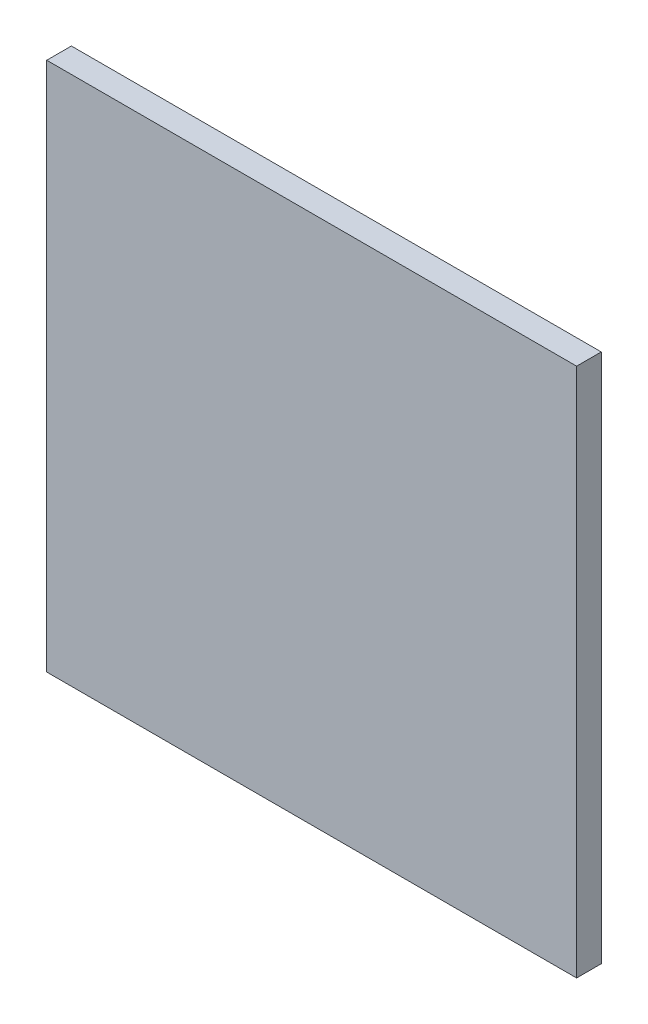
ISO-10303-21;
HEADER;
FILE_DESCRIPTION(('STEP AP214'),'2;1');
FILE_NAME('part.step','',(''),(''),'','','');
FILE_SCHEMA(('AUTOMOTIVE_DESIGN { 1 0 10303 214 1 1 1 1 }'));
ENDSEC;
DATA;
#1=APPLICATION_CONTEXT('core data for automotive mechanical design processes');
#2=APPLICATION_PROTOCOL_DEFINITION('international standard','automotive_design',2000,#1);
#3=PRODUCT_CONTEXT('',#1,'mechanical');
#4=PRODUCT('Part','Part','',(#3));
#5=PRODUCT_RELATED_PRODUCT_CATEGORY('part','',(#4));
#6=PRODUCT_DEFINITION_FORMATION('','',#4);
#7=PRODUCT_DEFINITION_CONTEXT('part definition',#1,'design');
#8=PRODUCT_DEFINITION('design','',#6,#7);
#9=PRODUCT_DEFINITION_SHAPE('','',#8);
#10=(LENGTH_UNIT() NAMED_UNIT(*) SI_UNIT(.MILLI.,.METRE.));
#11=(NAMED_UNIT(*) PLANE_ANGLE_UNIT() SI_UNIT($,.RADIAN.));
#12=(NAMED_UNIT(*) SI_UNIT($,.STERADIAN.) SOLID_ANGLE_UNIT());
#13=UNCERTAINTY_MEASURE_WITH_UNIT(LENGTH_MEASURE(1.E-05),#10,'distance_accuracy_value','');
#14=(GEOMETRIC_REPRESENTATION_CONTEXT(3) GLOBAL_UNCERTAINTY_ASSIGNED_CONTEXT((#13)) GLOBAL_UNIT_ASSIGNED_CONTEXT((#10,
#11,#12)) REPRESENTATION_CONTEXT('',''));
#15=CARTESIAN_POINT('',(0.,0.,0.));
#16=DIRECTION('',(0.,0.,1.));
#17=DIRECTION('',(1.,0.,0.));
#18=AXIS2_PLACEMENT_3D('',#15,#16,#17);
#19=CARTESIAN_POINT('',(-0.2149983,-0.2149983,0.02));
#20=DIRECTION('',(0.,0.,1.));
#21=DIRECTION('',(1.,0.,0.));
#22=AXIS2_PLACEMENT_3D('',#19,#20,#21);
#23=PLANE('',#22);
#24=DIRECTION('',(1.,0.,0.));
#25=VECTOR('',#24,1.);
#26=CARTESIAN_POINT('',(-0.2149983,0.2149983,0.02));
#27=LINE('',#26,#25);
#28=CARTESIAN_POINT('',(-0.2149983,0.2149983,0.02));
#29=VERTEX_POINT('',#28);
#30=CARTESIAN_POINT('',(0.2149983,0.2149983,0.02));
#31=VERTEX_POINT('',#30);
#32=EDGE_CURVE('E53',#29,#31,#27,.T.);
#33=ORIENTED_EDGE('',*,*,#32,.F.);
#34=DIRECTION('',(0.,1.,0.));
#35=VECTOR('',#34,1.);
#36=CARTESIAN_POINT('',(-0.2149983,-0.2149983,0.02));
#37=LINE('',#36,#35);
#38=CARTESIAN_POINT('',(-0.2149983,-0.2149983,0.02));
#39=VERTEX_POINT('',#38);
#40=EDGE_CURVE('E68',#39,#29,#37,.T.);
#41=ORIENTED_EDGE('',*,*,#40,.F.);
#42=DIRECTION('',(1.,0.,0.));
#43=VECTOR('',#42,1.);
#44=CARTESIAN_POINT('',(0.2149983,-0.2149983,0.02));
#45=LINE('',#44,#43);
#46=CARTESIAN_POINT('',(0.2149983,-0.2149983,0.02));
#47=VERTEX_POINT('',#46);
#48=EDGE_CURVE('E20',#47,#39,#45,.F.);
#49=ORIENTED_EDGE('',*,*,#48,.F.);
#50=DIRECTION('',(0.,1.,0.));
#51=VECTOR('',#50,1.);
#52=CARTESIAN_POINT('',(0.2149983,0.2149983,0.02));
#53=LINE('',#52,#51);
#54=EDGE_CURVE('E58',#31,#47,#53,.F.);
#55=ORIENTED_EDGE('',*,*,#54,.F.);
#56=EDGE_LOOP('',(#33,#41,#49,#55));
#57=FACE_BOUND('',#56,.T.);
#58=ADVANCED_FACE('F17',(#57),#23,.T.);
#59=CARTESIAN_POINT('',(0.2149983,-0.2149983,0.));
#60=DIRECTION('',(0.,-1.,0.));
#61=DIRECTION('',(0.,0.,-1.));
#62=AXIS2_PLACEMENT_3D('',#59,#60,#61);
#63=PLANE('',#62);
#64=DIRECTION('',(0.,0.,1.));
#65=VECTOR('',#64,1.);
#66=CARTESIAN_POINT('',(-0.2149983,-0.2149983,0.));
#67=LINE('',#66,#65);
#68=CARTESIAN_POINT('',(-0.2149983,-0.2149983,0.));
#69=VERTEX_POINT('',#68);
#70=EDGE_CURVE('E79',#69,#39,#67,.T.);
#71=ORIENTED_EDGE('',*,*,#70,.F.);
#72=DIRECTION('',(1.,0.,0.));
#73=VECTOR('',#72,1.);
#74=CARTESIAN_POINT('',(-0.2149983,-0.2149983,0.));
#75=LINE('',#74,#73);
#76=CARTESIAN_POINT('',(0.2149983,-0.2149983,0.));
#77=VERTEX_POINT('',#76);
#78=EDGE_CURVE('E74',#69,#77,#75,.T.);
#79=ORIENTED_EDGE('',*,*,#78,.T.);
#80=DIRECTION('',(0.,0.,-1.));
#81=VECTOR('',#80,1.);
#82=CARTESIAN_POINT('',(0.2149983,-0.2149983,0.));
#83=LINE('',#82,#81);
#84=EDGE_CURVE('E63',#47,#77,#83,.T.);
#85=ORIENTED_EDGE('',*,*,#84,.F.);
#86=ORIENTED_EDGE('',*,*,#48,.T.);
#87=EDGE_LOOP('',(#71,#79,#85,#86));
#88=FACE_BOUND('',#87,.T.);
#89=ADVANCED_FACE('F73',(#88),#63,.T.);
#90=CARTESIAN_POINT('',(0.2149983,0.2149983,0.));
#91=DIRECTION('',(1.,0.,0.));
#92=DIRECTION('',(0.,0.,-1.));
#93=AXIS2_PLACEMENT_3D('',#90,#91,#92);
#94=PLANE('',#93);
#95=ORIENTED_EDGE('',*,*,#84,.T.);
#96=DIRECTION('',(0.,1.,0.));
#97=VECTOR('',#96,1.);
#98=CARTESIAN_POINT('',(0.2149983,-0.2149983,0.));
#99=LINE('',#98,#97);
#100=CARTESIAN_POINT('',(0.2149983,0.2149983,0.));
#101=VERTEX_POINT('',#100);
#102=EDGE_CURVE('E84',#77,#101,#99,.T.);
#103=ORIENTED_EDGE('',*,*,#102,.T.);
#104=DIRECTION('',(0.,0.,1.));
#105=VECTOR('',#104,1.);
#106=CARTESIAN_POINT('',(0.2149983,0.2149983,0.));
#107=LINE('',#106,#105);
#108=EDGE_CURVE('E65',#31,#101,#107,.F.);
#109=ORIENTED_EDGE('',*,*,#108,.F.);
#110=ORIENTED_EDGE('',*,*,#54,.T.);
#111=EDGE_LOOP('',(#95,#103,#109,#110));
#112=FACE_BOUND('',#111,.T.);
#113=ADVANCED_FACE('F60',(#112),#94,.T.);
#114=CARTESIAN_POINT('',(-0.2149983,0.2149983,0.));
#115=DIRECTION('',(0.,1.,0.));
#116=DIRECTION('',(0.,0.,1.));
#117=AXIS2_PLACEMENT_3D('',#114,#115,#116);
#118=PLANE('',#117);
#119=ORIENTED_EDGE('',*,*,#108,.T.);
#120=DIRECTION('',(1.,0.,0.));
#121=VECTOR('',#120,1.);
#122=CARTESIAN_POINT('',(-0.2149983,0.2149983,0.));
#123=LINE('',#122,#121);
#124=CARTESIAN_POINT('',(-0.2149983,0.2149983,0.));
#125=VERTEX_POINT('',#124);
#126=EDGE_CURVE('E26',#101,#125,#123,.F.);
#127=ORIENTED_EDGE('',*,*,#126,.T.);
#128=DIRECTION('',(0.,0.,1.));
#129=VECTOR('',#128,1.);
#130=CARTESIAN_POINT('',(-0.2149983,0.2149983,0.));
#131=LINE('',#130,#129);
#132=EDGE_CURVE('E34',#29,#125,#131,.F.);
#133=ORIENTED_EDGE('',*,*,#132,.F.);
#134=ORIENTED_EDGE('',*,*,#32,.T.);
#135=EDGE_LOOP('',(#119,#127,#133,#134));
#136=FACE_BOUND('',#135,.T.);
#137=ADVANCED_FACE('F88',(#136),#118,.T.);
#138=CARTESIAN_POINT('',(-0.2149983,-0.2149983,0.));
#139=DIRECTION('',(-1.,0.,0.));
#140=DIRECTION('',(0.,0.,1.));
#141=AXIS2_PLACEMENT_3D('',#138,#139,#140);
#142=PLANE('',#141);
#143=ORIENTED_EDGE('',*,*,#132,.T.);
#144=DIRECTION('',(0.,1.,0.));
#145=VECTOR('',#144,1.);
#146=CARTESIAN_POINT('',(-0.2149983,-0.2149983,0.));
#147=LINE('',#146,#145);
#148=EDGE_CURVE('E11',#125,#69,#147,.F.);
#149=ORIENTED_EDGE('',*,*,#148,.T.);
#150=ORIENTED_EDGE('',*,*,#70,.T.);
#151=ORIENTED_EDGE('',*,*,#40,.T.);
#152=EDGE_LOOP('',(#143,#149,#150,#151));
#153=FACE_BOUND('',#152,.T.);
#154=ADVANCED_FACE('F91',(#153),#142,.T.);
#155=CARTESIAN_POINT('',(-0.2149983,-0.2149983,0.));
#156=DIRECTION('',(0.,0.,1.));
#157=DIRECTION('',(1.,0.,0.));
#158=AXIS2_PLACEMENT_3D('',#155,#156,#157);
#159=PLANE('',#158);
#160=ORIENTED_EDGE('',*,*,#126,.F.);
#161=ORIENTED_EDGE('',*,*,#102,.F.);
#162=ORIENTED_EDGE('',*,*,#78,.F.);
#163=ORIENTED_EDGE('',*,*,#148,.F.);
#164=EDGE_LOOP('',(#160,#161,#162,#163));
#165=FACE_BOUND('',#164,.T.);
#166=ADVANCED_FACE('F90',(#165),#159,.F.);
#167=CLOSED_SHELL('',(#58,#89,#113,#137,#154,#166));
#168=MANIFOLD_SOLID_BREP('B1',#167);
#169=ADVANCED_BREP_SHAPE_REPRESENTATION('',(#18,#168),#14);
#170=SHAPE_DEFINITION_REPRESENTATION(#9,#169);
ENDSEC;
END-ISO-10303-21;
